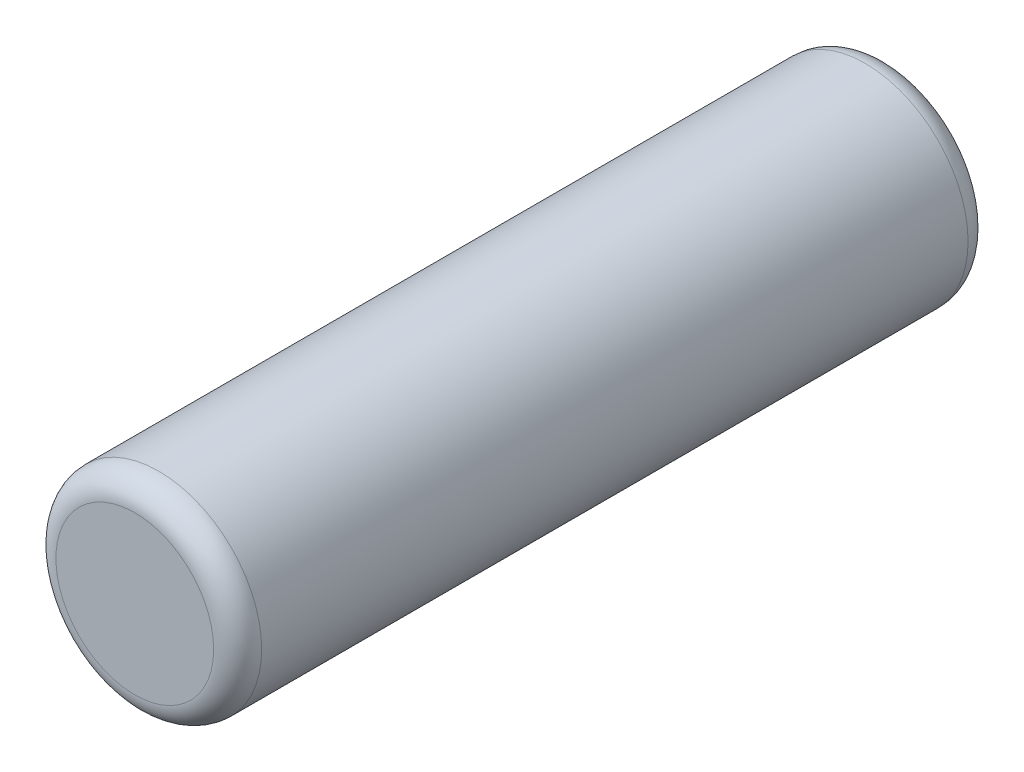
ISO-10303-21;
HEADER;
FILE_DESCRIPTION(('STEP AP214'),'2;1');
FILE_NAME('part.step','',(''),(''),'','','');
FILE_SCHEMA(('AUTOMOTIVE_DESIGN { 1 0 10303 214 1 1 1 1 }'));
ENDSEC;
DATA;
#1=APPLICATION_CONTEXT('core data for automotive mechanical design processes');
#2=APPLICATION_PROTOCOL_DEFINITION('international standard','automotive_design',2000,#1);
#3=PRODUCT_CONTEXT('',#1,'mechanical');
#4=PRODUCT('Part','Part','',(#3));
#5=PRODUCT_RELATED_PRODUCT_CATEGORY('part','',(#4));
#6=PRODUCT_DEFINITION_FORMATION('','',#4);
#7=PRODUCT_DEFINITION_CONTEXT('part definition',#1,'design');
#8=PRODUCT_DEFINITION('design','',#6,#7);
#9=PRODUCT_DEFINITION_SHAPE('','',#8);
#10=(LENGTH_UNIT() NAMED_UNIT(*) SI_UNIT(.MILLI.,.METRE.));
#11=(NAMED_UNIT(*) PLANE_ANGLE_UNIT() SI_UNIT($,.RADIAN.));
#12=(NAMED_UNIT(*) SI_UNIT($,.STERADIAN.) SOLID_ANGLE_UNIT());
#13=UNCERTAINTY_MEASURE_WITH_UNIT(LENGTH_MEASURE(1.E-05),#10,'distance_accuracy_value','');
#14=(GEOMETRIC_REPRESENTATION_CONTEXT(3) GLOBAL_UNCERTAINTY_ASSIGNED_CONTEXT((#13)) GLOBAL_UNIT_ASSIGNED_CONTEXT((#10,
#11,#12)) REPRESENTATION_CONTEXT('',''));
#15=CARTESIAN_POINT('',(0.,0.,0.));
#16=DIRECTION('',(0.,0.,1.));
#17=DIRECTION('',(1.,0.,0.));
#18=AXIS2_PLACEMENT_3D('',#15,#16,#17);
#19=CARTESIAN_POINT('',(0.,0.,5.5));
#20=DIRECTION('',(0.,0.,-1.));
#21=DIRECTION('',(-1.,0.,0.));
#22=AXIS2_PLACEMENT_3D('',#19,#20,#21);
#23=CYLINDRICAL_SURFACE('',#22,1.5);
#24=CARTESIAN_POINT('',(0.,0.,-5.15));
#25=DIRECTION('',(0.,0.,1.));
#26=DIRECTION('',(1.,0.,0.));
#27=AXIS2_PLACEMENT_3D('',#24,#25,#26);
#28=CIRCLE('',#27,1.5);
#29=CARTESIAN_POINT('',(1.5,0.,-5.15));
#30=VERTEX_POINT('',#29);
#31=EDGE_CURVE('E42',#30,#30,#28,.T.);
#32=ORIENTED_EDGE('',*,*,#31,.T.);
#33=EDGE_LOOP('',(#32));
#34=FACE_BOUND('',#33,.T.);
#35=CARTESIAN_POINT('',(0.,0.,5.15));
#36=DIRECTION('',(0.,0.,1.));
#37=DIRECTION('',(1.,0.,0.));
#38=AXIS2_PLACEMENT_3D('',#35,#36,#37);
#39=CIRCLE('',#38,1.5);
#40=CARTESIAN_POINT('',(1.5,0.,5.15));
#41=VERTEX_POINT('',#40);
#42=EDGE_CURVE('E46',#41,#41,#39,.F.);
#43=ORIENTED_EDGE('',*,*,#42,.T.);
#44=EDGE_LOOP('',(#43));
#45=FACE_BOUND('',#44,.T.);
#46=ADVANCED_FACE('F31',(#34,#45),#23,.T.);
#47=CARTESIAN_POINT('',(0.,0.,5.5));
#48=DIRECTION('',(0.,0.,1.));
#49=DIRECTION('',(1.,0.,0.));
#50=AXIS2_PLACEMENT_3D('',#47,#48,#49);
#51=PLANE('',#50);
#52=CARTESIAN_POINT('',(0.,0.,5.5));
#53=DIRECTION('',(0.,0.,1.));
#54=DIRECTION('',(1.,0.,0.));
#55=AXIS2_PLACEMENT_3D('',#52,#53,#54);
#56=CIRCLE('',#55,1.15);
#57=CARTESIAN_POINT('',(1.15,0.,5.5));
#58=VERTEX_POINT('',#57);
#59=EDGE_CURVE('E10',#58,#58,#56,.T.);
#60=ORIENTED_EDGE('',*,*,#59,.T.);
#61=EDGE_LOOP('',(#60));
#62=FACE_BOUND('',#61,.T.);
#63=ADVANCED_FACE('F62',(#62),#51,.T.);
#64=CARTESIAN_POINT('',(0.,0.,-5.5));
#65=DIRECTION('',(0.,0.,1.));
#66=DIRECTION('',(1.,0.,0.));
#67=AXIS2_PLACEMENT_3D('',#64,#65,#66);
#68=PLANE('',#67);
#69=CARTESIAN_POINT('',(0.,0.,-5.5));
#70=DIRECTION('',(0.,0.,1.));
#71=DIRECTION('',(1.,0.,0.));
#72=AXIS2_PLACEMENT_3D('',#69,#70,#71);
#73=CIRCLE('',#72,1.15);
#74=CARTESIAN_POINT('',(1.15,0.,-5.5));
#75=VERTEX_POINT('',#74);
#76=EDGE_CURVE('E38',#75,#75,#73,.F.);
#77=ORIENTED_EDGE('',*,*,#76,.T.);
#78=EDGE_LOOP('',(#77));
#79=FACE_BOUND('',#78,.T.);
#80=ADVANCED_FACE('F59',(#79),#68,.F.);
#81=CARTESIAN_POINT('',(0.,0.,-5.15));
#82=DIRECTION('',(0.,0.,1.));
#83=DIRECTION('',(1.,0.,0.));
#84=AXIS2_PLACEMENT_3D('',#81,#82,#83);
#85=TOROIDAL_SURFACE('',#84,1.15,0.35);
#86=ORIENTED_EDGE('',*,*,#76,.F.);
#87=EDGE_LOOP('',(#86));
#88=FACE_BOUND('',#87,.T.);
#89=ORIENTED_EDGE('',*,*,#31,.F.);
#90=EDGE_LOOP('',(#89));
#91=FACE_BOUND('',#90,.T.);
#92=ADVANCED_FACE('F55',(#88,#91),#85,.T.);
#93=CARTESIAN_POINT('',(0.,0.,5.15));
#94=DIRECTION('',(0.,0.,1.));
#95=DIRECTION('',(1.,0.,0.));
#96=AXIS2_PLACEMENT_3D('',#93,#94,#95);
#97=TOROIDAL_SURFACE('',#96,1.15,0.35);
#98=ORIENTED_EDGE('',*,*,#42,.F.);
#99=EDGE_LOOP('',(#98));
#100=FACE_BOUND('',#99,.T.);
#101=ORIENTED_EDGE('',*,*,#59,.F.);
#102=EDGE_LOOP('',(#101));
#103=FACE_BOUND('',#102,.T.);
#104=ADVANCED_FACE('F33',(#100,#103),#97,.T.);
#105=CLOSED_SHELL('',(#46,#63,#80,#92,#104));
#106=MANIFOLD_SOLID_BREP('B2',#105);
#107=ADVANCED_BREP_SHAPE_REPRESENTATION('',(#18,#106),#14);
#108=SHAPE_DEFINITION_REPRESENTATION(#9,#107);
ENDSEC;
END-ISO-10303-21;
